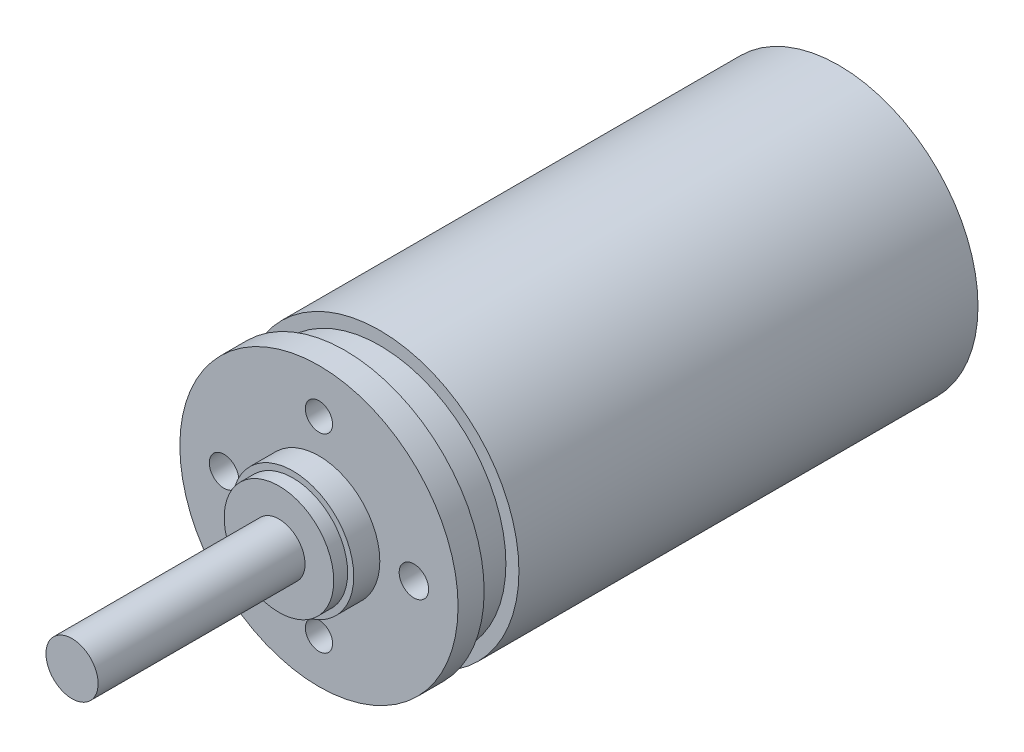
ISO-10303-21;
HEADER;
FILE_DESCRIPTION(('STEP AP214'),'2;1');
FILE_NAME('part.step','',(''),(''),'','','');
FILE_SCHEMA(('AUTOMOTIVE_DESIGN { 1 0 10303 214 1 1 1 1 }'));
ENDSEC;
DATA;
#1=APPLICATION_CONTEXT('core data for automotive mechanical design processes');
#2=APPLICATION_PROTOCOL_DEFINITION('international standard','automotive_design',2000,#1);
#3=PRODUCT_CONTEXT('',#1,'mechanical');
#4=PRODUCT('Part','Part','',(#3));
#5=PRODUCT_RELATED_PRODUCT_CATEGORY('part','',(#4));
#6=PRODUCT_DEFINITION_FORMATION('','',#4);
#7=PRODUCT_DEFINITION_CONTEXT('part definition',#1,'design');
#8=PRODUCT_DEFINITION('design','',#6,#7);
#9=PRODUCT_DEFINITION_SHAPE('','',#8);
#10=(LENGTH_UNIT() NAMED_UNIT(*) SI_UNIT(.MILLI.,.METRE.));
#11=(NAMED_UNIT(*) PLANE_ANGLE_UNIT() SI_UNIT($,.RADIAN.));
#12=(NAMED_UNIT(*) SI_UNIT($,.STERADIAN.) SOLID_ANGLE_UNIT());
#13=UNCERTAINTY_MEASURE_WITH_UNIT(LENGTH_MEASURE(1.E-05),#10,'distance_accuracy_value','');
#14=(GEOMETRIC_REPRESENTATION_CONTEXT(3) GLOBAL_UNCERTAINTY_ASSIGNED_CONTEXT((#13)) GLOBAL_UNIT_ASSIGNED_CONTEXT((#10,
#11,#12)) REPRESENTATION_CONTEXT('',''));
#15=CARTESIAN_POINT('',(0.,0.,0.));
#16=DIRECTION('',(0.,0.,1.));
#17=DIRECTION('',(1.,0.,0.));
#18=AXIS2_PLACEMENT_3D('',#15,#16,#17);
#19=CARTESIAN_POINT('',(0.,-0.750000000000002,14.2));
#20=DIRECTION('',(0.,0.,1.));
#21=DIRECTION('',(1.,0.,0.));
#22=AXIS2_PLACEMENT_3D('',#19,#20,#21);
#23=PLANE('',#22);
#24=CARTESIAN_POINT('',(0.,0.,14.2));
#25=DIRECTION('',(0.,0.,1.));
#26=DIRECTION('',(1.,0.,0.));
#27=AXIS2_PLACEMENT_3D('',#24,#25,#26);
#28=CIRCLE('',#27,1.5);
#29=CARTESIAN_POINT('',(1.5,0.,14.2));
#30=VERTEX_POINT('',#29);
#31=EDGE_CURVE('E19',#30,#30,#28,.F.);
#32=ORIENTED_EDGE('',*,*,#31,.F.);
#33=EDGE_LOOP('',(#32));
#34=FACE_BOUND('',#33,.T.);
#35=ADVANCED_FACE('F16',(#34),#23,.T.);
#36=CARTESIAN_POINT('',(0.,-1.5,9.9));
#37=DIRECTION('',(0.,0.,1.));
#38=DIRECTION('',(1.,0.,0.));
#39=AXIS2_PLACEMENT_3D('',#36,#37,#38);
#40=PLANE('',#39);
#41=DIRECTION('',(1.,0.,0.));
#42=VECTOR('',#41,1.);
#43=CARTESIAN_POINT('',(0.,-1.3,9.9));
#44=LINE('',#43,#42);
#45=CARTESIAN_POINT('',(-0.748331477354788,-1.3,9.9));
#46=VERTEX_POINT('',#45);
#47=CARTESIAN_POINT('',(0.748331477354788,-1.3,9.9));
#48=VERTEX_POINT('',#47);
#49=EDGE_CURVE('E40',#46,#48,#44,.T.);
#50=ORIENTED_EDGE('',*,*,#49,.T.);
#51=CARTESIAN_POINT('',(0.,0.,9.9));
#52=DIRECTION('',(0.,0.,1.));
#53=DIRECTION('',(1.,0.,0.));
#54=AXIS2_PLACEMENT_3D('',#51,#52,#53);
#55=CIRCLE('',#54,1.5);
#56=EDGE_CURVE('E50',#46,#48,#55,.T.);
#57=ORIENTED_EDGE('',*,*,#56,.F.);
#58=EDGE_LOOP('',(#50,#57));
#59=FACE_BOUND('',#58,.T.);
#60=ADVANCED_FACE('F51',(#59),#40,.F.);
#61=CARTESIAN_POINT('',(0.,-1.3,9.9));
#62=DIRECTION('',(0.,1.,0.));
#63=DIRECTION('',(0.,0.,1.));
#64=AXIS2_PLACEMENT_3D('',#61,#62,#63);
#65=PLANE('',#64);
#66=ORIENTED_EDGE('',*,*,#49,.F.);
#67=DIRECTION('',(0.,0.,1.));
#68=VECTOR('',#67,1.);
#69=CARTESIAN_POINT('',(-0.748331477354789,-1.3,8.25));
#70=LINE('',#69,#68);
#71=CARTESIAN_POINT('',(-0.748331477354788,-1.3,3.2));
#72=VERTEX_POINT('',#71);
#73=EDGE_CURVE('E44',#72,#46,#70,.T.);
#74=ORIENTED_EDGE('',*,*,#73,.F.);
#75=DIRECTION('',(-1.,0.,0.));
#76=VECTOR('',#75,1.);
#77=CARTESIAN_POINT('',(0.,-1.3,3.2));
#78=LINE('',#77,#76);
#79=CARTESIAN_POINT('',(0.748331477354788,-1.3,3.2));
#80=VERTEX_POINT('',#79);
#81=EDGE_CURVE('E33',#72,#80,#78,.F.);
#82=ORIENTED_EDGE('',*,*,#81,.T.);
#83=DIRECTION('',(0.,0.,1.));
#84=VECTOR('',#83,1.);
#85=CARTESIAN_POINT('',(0.748331477354788,-1.3,8.25));
#86=LINE('',#85,#84);
#87=EDGE_CURVE('E46',#48,#80,#86,.F.);
#88=ORIENTED_EDGE('',*,*,#87,.F.);
#89=EDGE_LOOP('',(#66,#74,#82,#88));
#90=FACE_BOUND('',#89,.T.);
#91=ADVANCED_FACE('F42',(#90),#65,.F.);
#92=CARTESIAN_POINT('',(0.,-1.3,3.2));
#93=DIRECTION('',(0.,0.,-1.));
#94=DIRECTION('',(-1.,0.,0.));
#95=AXIS2_PLACEMENT_3D('',#92,#93,#94);
#96=PLANE('',#95);
#97=ORIENTED_EDGE('',*,*,#81,.F.);
#98=CARTESIAN_POINT('',(0.,0.,3.2));
#99=DIRECTION('',(0.,0.,1.));
#100=DIRECTION('',(1.,0.,0.));
#101=AXIS2_PLACEMENT_3D('',#98,#99,#100);
#102=CIRCLE('',#101,1.5);
#103=EDGE_CURVE('E56',#80,#72,#102,.F.);
#104=ORIENTED_EDGE('',*,*,#103,.F.);
#105=EDGE_LOOP('',(#97,#104));
#106=FACE_BOUND('',#105,.T.);
#107=ADVANCED_FACE('F127',(#106),#96,.F.);
#108=CARTESIAN_POINT('',(0.,0.,8.25));
#109=DIRECTION('',(0.,0.,1.));
#110=DIRECTION('',(1.,0.,0.));
#111=AXIS2_PLACEMENT_3D('',#108,#109,#110);
#112=CYLINDRICAL_SURFACE('',#111,1.5);
#113=CARTESIAN_POINT('',(0.,0.,2.3));
#114=DIRECTION('',(0.,0.,1.));
#115=DIRECTION('',(1.,0.,0.));
#116=AXIS2_PLACEMENT_3D('',#113,#114,#115);
#117=CIRCLE('',#116,1.5);
#118=CARTESIAN_POINT('',(1.5,0.,2.3));
#119=VERTEX_POINT('',#118);
#120=EDGE_CURVE('E118',#119,#119,#117,.F.);
#121=ORIENTED_EDGE('',*,*,#120,.F.);
#122=EDGE_LOOP('',(#121));
#123=FACE_BOUND('',#122,.T.);
#124=ORIENTED_EDGE('',*,*,#87,.T.);
#125=ORIENTED_EDGE('',*,*,#103,.T.);
#126=ORIENTED_EDGE('',*,*,#73,.T.);
#127=ORIENTED_EDGE('',*,*,#56,.T.);
#128=EDGE_LOOP('',(#124,#125,#126,#127));
#129=FACE_BOUND('',#128,.T.);
#130=ORIENTED_EDGE('',*,*,#31,.T.);
#131=EDGE_LOOP('',(#130));
#132=FACE_BOUND('',#131,.T.);
#133=ADVANCED_FACE('F54',(#123,#129,#132),#112,.T.);
#134=CARTESIAN_POINT('',(0.,-2.325,2.3));
#135=DIRECTION('',(0.,0.,1.));
#136=DIRECTION('',(1.,0.,0.));
#137=AXIS2_PLACEMENT_3D('',#134,#135,#136);
#138=PLANE('',#137);
#139=ORIENTED_EDGE('',*,*,#120,.T.);
#140=EDGE_LOOP('',(#139));
#141=FACE_BOUND('',#140,.T.);
#142=CARTESIAN_POINT('',(0.,0.,2.3));
#143=DIRECTION('',(0.,0.,1.));
#144=DIRECTION('',(1.,0.,0.));
#145=AXIS2_PLACEMENT_3D('',#142,#143,#144);
#146=CIRCLE('',#145,3.15);
#147=CARTESIAN_POINT('',(3.15,0.,2.3));
#148=VERTEX_POINT('',#147);
#149=EDGE_CURVE('E115',#148,#148,#146,.F.);
#150=ORIENTED_EDGE('',*,*,#149,.F.);
#151=EDGE_LOOP('',(#150));
#152=FACE_BOUND('',#151,.T.);
#153=ADVANCED_FACE('F123',(#141,#152),#138,.T.);
#154=CARTESIAN_POINT('',(0.,0.,1.9));
#155=DIRECTION('',(0.,0.,1.));
#156=DIRECTION('',(1.,0.,0.));
#157=AXIS2_PLACEMENT_3D('',#154,#155,#156);
#158=CYLINDRICAL_SURFACE('',#157,3.15);
#159=CARTESIAN_POINT('',(0.,0.,1.5));
#160=DIRECTION('',(0.,0.,1.));
#161=DIRECTION('',(1.,0.,0.));
#162=AXIS2_PLACEMENT_3D('',#159,#160,#161);
#163=CIRCLE('',#162,3.15);
#164=CARTESIAN_POINT('',(3.15,0.,1.5));
#165=VERTEX_POINT('',#164);
#166=EDGE_CURVE('E112',#165,#165,#163,.F.);
#167=ORIENTED_EDGE('',*,*,#166,.F.);
#168=EDGE_LOOP('',(#167));
#169=FACE_BOUND('',#168,.T.);
#170=ORIENTED_EDGE('',*,*,#149,.T.);
#171=EDGE_LOOP('',(#170));
#172=FACE_BOUND('',#171,.T.);
#173=ADVANCED_FACE('F134',(#169,#172),#158,.T.);
#174=CARTESIAN_POINT('',(0.,5.46,-3.));
#175=DIRECTION('',(0.,0.,-1.));
#176=DIRECTION('',(-1.,0.,0.));
#177=AXIS2_PLACEMENT_3D('',#174,#175,#176);
#178=PLANE('',#177);
#179=CARTESIAN_POINT('',(0.,5.46,-3.));
#180=DIRECTION('',(0.,0.,-1.));
#181=DIRECTION('',(-1.,0.,0.));
#182=AXIS2_PLACEMENT_3D('',#179,#180,#181);
#183=CIRCLE('',#182,0.7835);
#184=CARTESIAN_POINT('',(-0.7835,5.46,-3.));
#185=VERTEX_POINT('',#184);
#186=EDGE_CURVE('E109',#185,#185,#183,.F.);
#187=ORIENTED_EDGE('',*,*,#186,.T.);
#188=EDGE_LOOP('',(#187));
#189=FACE_BOUND('',#188,.T.);
#190=ADVANCED_FACE('F213',(#189),#178,.F.);
#191=CARTESIAN_POINT('',(0.,-5.46,-3.));
#192=DIRECTION('',(0.,0.,1.));
#193=DIRECTION('',(1.,0.,0.));
#194=AXIS2_PLACEMENT_3D('',#191,#192,#193);
#195=PLANE('',#194);
#196=CARTESIAN_POINT('',(0.,-5.46,-3.));
#197=DIRECTION('',(0.,0.,1.));
#198=DIRECTION('',(1.,0.,0.));
#199=AXIS2_PLACEMENT_3D('',#196,#197,#198);
#200=CIRCLE('',#199,0.7835);
#201=CARTESIAN_POINT('',(0.7835,-5.46,-3.));
#202=VERTEX_POINT('',#201);
#203=EDGE_CURVE('E106',#202,#202,#200,.T.);
#204=ORIENTED_EDGE('',*,*,#203,.T.);
#205=EDGE_LOOP('',(#204));
#206=FACE_BOUND('',#205,.T.);
#207=ADVANCED_FACE('F209',(#206),#195,.T.);
#208=CARTESIAN_POINT('',(5.46,0.,-3.));
#209=DIRECTION('',(0.,0.,-1.));
#210=DIRECTION('',(-1.,0.,0.));
#211=AXIS2_PLACEMENT_3D('',#208,#209,#210);
#212=PLANE('',#211);
#213=CARTESIAN_POINT('',(5.46,0.,-3.));
#214=DIRECTION('',(0.,0.,-1.));
#215=DIRECTION('',(-1.,0.,0.));
#216=AXIS2_PLACEMENT_3D('',#213,#214,#215);
#217=CIRCLE('',#216,0.847);
#218=CARTESIAN_POINT('',(4.613,0.,-3.));
#219=VERTEX_POINT('',#218);
#220=EDGE_CURVE('E103',#219,#219,#217,.F.);
#221=ORIENTED_EDGE('',*,*,#220,.T.);
#222=EDGE_LOOP('',(#221));
#223=FACE_BOUND('',#222,.T.);
#224=ADVANCED_FACE('F205',(#223),#212,.F.);
#225=CARTESIAN_POINT('',(-5.46,0.,-3.));
#226=DIRECTION('',(0.,0.,1.));
#227=DIRECTION('',(1.,0.,0.));
#228=AXIS2_PLACEMENT_3D('',#225,#226,#227);
#229=PLANE('',#228);
#230=CARTESIAN_POINT('',(-5.46,0.,-3.));
#231=DIRECTION('',(0.,0.,1.));
#232=DIRECTION('',(1.,0.,0.));
#233=AXIS2_PLACEMENT_3D('',#230,#231,#232);
#234=CIRCLE('',#233,0.847);
#235=CARTESIAN_POINT('',(-4.613,0.,-3.));
#236=VERTEX_POINT('',#235);
#237=EDGE_CURVE('E100',#236,#236,#234,.T.);
#238=ORIENTED_EDGE('',*,*,#237,.T.);
#239=EDGE_LOOP('',(#238));
#240=FACE_BOUND('',#239,.T.);
#241=ADVANCED_FACE('F201',(#240),#229,.T.);
#242=CARTESIAN_POINT('',(0.,-3.325,1.5));
#243=DIRECTION('',(0.,0.,1.));
#244=DIRECTION('',(1.,0.,0.));
#245=AXIS2_PLACEMENT_3D('',#242,#243,#244);
#246=PLANE('',#245);
#247=ORIENTED_EDGE('',*,*,#166,.T.);
#248=EDGE_LOOP('',(#247));
#249=FACE_BOUND('',#248,.T.);
#250=CARTESIAN_POINT('',(0.,0.,1.5));
#251=DIRECTION('',(0.,0.,1.));
#252=DIRECTION('',(1.,0.,0.));
#253=AXIS2_PLACEMENT_3D('',#250,#251,#252);
#254=CIRCLE('',#253,3.5);
#255=CARTESIAN_POINT('',(3.5,0.,1.5));
#256=VERTEX_POINT('',#255);
#257=EDGE_CURVE('E97',#256,#256,#254,.F.);
#258=ORIENTED_EDGE('',*,*,#257,.F.);
#259=EDGE_LOOP('',(#258));
#260=FACE_BOUND('',#259,.T.);
#261=ADVANCED_FACE('F197',(#249,#260),#246,.T.);
#262=CARTESIAN_POINT('',(0.,5.46,-1.5));
#263=DIRECTION('',(0.,0.,-1.));
#264=DIRECTION('',(-1.,0.,0.));
#265=AXIS2_PLACEMENT_3D('',#262,#263,#264);
#266=CYLINDRICAL_SURFACE('',#265,0.7835);
#267=ORIENTED_EDGE('',*,*,#186,.F.);
#268=EDGE_LOOP('',(#267));
#269=FACE_BOUND('',#268,.T.);
#270=CARTESIAN_POINT('',(0.,5.46,0.));
#271=DIRECTION('',(0.,0.,-1.));
#272=DIRECTION('',(-1.,0.,0.));
#273=AXIS2_PLACEMENT_3D('',#270,#271,#272);
#274=CIRCLE('',#273,0.7835);
#275=CARTESIAN_POINT('',(-0.7835,5.46,0.));
#276=VERTEX_POINT('',#275);
#277=EDGE_CURVE('E94',#276,#276,#274,.T.);
#278=ORIENTED_EDGE('',*,*,#277,.F.);
#279=EDGE_LOOP('',(#278));
#280=FACE_BOUND('',#279,.T.);
#281=ADVANCED_FACE('F193',(#269,#280),#266,.F.);
#282=CARTESIAN_POINT('',(0.,-5.46,-1.5));
#283=DIRECTION('',(0.,0.,1.));
#284=DIRECTION('',(1.,0.,0.));
#285=AXIS2_PLACEMENT_3D('',#282,#283,#284);
#286=CYLINDRICAL_SURFACE('',#285,0.7835);
#287=ORIENTED_EDGE('',*,*,#203,.F.);
#288=EDGE_LOOP('',(#287));
#289=FACE_BOUND('',#288,.T.);
#290=CARTESIAN_POINT('',(0.,-5.46,0.));
#291=DIRECTION('',(0.,0.,1.));
#292=DIRECTION('',(1.,0.,0.));
#293=AXIS2_PLACEMENT_3D('',#290,#291,#292);
#294=CIRCLE('',#293,0.7835);
#295=CARTESIAN_POINT('',(0.7835,-5.46,0.));
#296=VERTEX_POINT('',#295);
#297=EDGE_CURVE('E91',#296,#296,#294,.F.);
#298=ORIENTED_EDGE('',*,*,#297,.F.);
#299=EDGE_LOOP('',(#298));
#300=FACE_BOUND('',#299,.T.);
#301=ADVANCED_FACE('F189',(#289,#300),#286,.F.);
#302=CARTESIAN_POINT('',(5.46,0.,-1.5));
#303=DIRECTION('',(0.,0.,-1.));
#304=DIRECTION('',(-1.,0.,0.));
#305=AXIS2_PLACEMENT_3D('',#302,#303,#304);
#306=CYLINDRICAL_SURFACE('',#305,0.847);
#307=ORIENTED_EDGE('',*,*,#220,.F.);
#308=EDGE_LOOP('',(#307));
#309=FACE_BOUND('',#308,.T.);
#310=CARTESIAN_POINT('',(5.46,0.,0.));
#311=DIRECTION('',(0.,0.,-1.));
#312=DIRECTION('',(-1.,0.,0.));
#313=AXIS2_PLACEMENT_3D('',#310,#311,#312);
#314=CIRCLE('',#313,0.847);
#315=CARTESIAN_POINT('',(4.613,0.,0.));
#316=VERTEX_POINT('',#315);
#317=EDGE_CURVE('E88',#316,#316,#314,.T.);
#318=ORIENTED_EDGE('',*,*,#317,.F.);
#319=EDGE_LOOP('',(#318));
#320=FACE_BOUND('',#319,.T.);
#321=ADVANCED_FACE('F185',(#309,#320),#306,.F.);
#322=CARTESIAN_POINT('',(-5.46,0.,-1.5));
#323=DIRECTION('',(0.,0.,1.));
#324=DIRECTION('',(1.,0.,0.));
#325=AXIS2_PLACEMENT_3D('',#322,#323,#324);
#326=CYLINDRICAL_SURFACE('',#325,0.847);
#327=ORIENTED_EDGE('',*,*,#237,.F.);
#328=EDGE_LOOP('',(#327));
#329=FACE_BOUND('',#328,.T.);
#330=CARTESIAN_POINT('',(-5.46,0.,0.));
#331=DIRECTION('',(0.,0.,1.));
#332=DIRECTION('',(1.,0.,0.));
#333=AXIS2_PLACEMENT_3D('',#330,#331,#332);
#334=CIRCLE('',#333,0.847);
#335=CARTESIAN_POINT('',(-4.613,0.,0.));
#336=VERTEX_POINT('',#335);
#337=EDGE_CURVE('E85',#336,#336,#334,.F.);
#338=ORIENTED_EDGE('',*,*,#337,.F.);
#339=EDGE_LOOP('',(#338));
#340=FACE_BOUND('',#339,.T.);
#341=ADVANCED_FACE('F181',(#329,#340),#326,.F.);
#342=CARTESIAN_POINT('',(0.,0.,0.75));
#343=DIRECTION('',(0.,0.,1.));
#344=DIRECTION('',(1.,0.,0.));
#345=AXIS2_PLACEMENT_3D('',#342,#343,#344);
#346=CYLINDRICAL_SURFACE('',#345,3.5);
#347=CARTESIAN_POINT('',(0.,0.,0.));
#348=DIRECTION('',(0.,0.,1.));
#349=DIRECTION('',(1.,0.,0.));
#350=AXIS2_PLACEMENT_3D('',#347,#348,#349);
#351=CIRCLE('',#350,3.5);
#352=CARTESIAN_POINT('',(3.5,0.,0.));
#353=VERTEX_POINT('',#352);
#354=EDGE_CURVE('E82',#353,#353,#351,.F.);
#355=ORIENTED_EDGE('',*,*,#354,.F.);
#356=EDGE_LOOP('',(#355));
#357=FACE_BOUND('',#356,.T.);
#358=ORIENTED_EDGE('',*,*,#257,.T.);
#359=EDGE_LOOP('',(#358));
#360=FACE_BOUND('',#359,.T.);
#361=ADVANCED_FACE('F177',(#357,#360),#346,.T.);
#362=CARTESIAN_POINT('',(0.,-5.75,0.));
#363=DIRECTION('',(0.,0.,1.));
#364=DIRECTION('',(1.,0.,0.));
#365=AXIS2_PLACEMENT_3D('',#362,#363,#364);
#366=PLANE('',#365);
#367=ORIENTED_EDGE('',*,*,#354,.T.);
#368=EDGE_LOOP('',(#367));
#369=FACE_BOUND('',#368,.T.);
#370=ORIENTED_EDGE('',*,*,#337,.T.);
#371=EDGE_LOOP('',(#370));
#372=FACE_BOUND('',#371,.T.);
#373=ORIENTED_EDGE('',*,*,#317,.T.);
#374=EDGE_LOOP('',(#373));
#375=FACE_BOUND('',#374,.T.);
#376=ORIENTED_EDGE('',*,*,#297,.T.);
#377=EDGE_LOOP('',(#376));
#378=FACE_BOUND('',#377,.T.);
#379=ORIENTED_EDGE('',*,*,#277,.T.);
#380=EDGE_LOOP('',(#379));
#381=FACE_BOUND('',#380,.T.);
#382=CARTESIAN_POINT('',(0.,0.,0.));
#383=DIRECTION('',(0.,0.,1.));
#384=DIRECTION('',(1.,0.,0.));
#385=AXIS2_PLACEMENT_3D('',#382,#383,#384);
#386=CIRCLE('',#385,8.);
#387=CARTESIAN_POINT('',(8.,0.,0.));
#388=VERTEX_POINT('',#387);
#389=EDGE_CURVE('E79',#388,#388,#386,.F.);
#390=ORIENTED_EDGE('',*,*,#389,.F.);
#391=EDGE_LOOP('',(#390));
#392=FACE_BOUND('',#391,.T.);
#393=ADVANCED_FACE('F173',(#369,#372,#375,#378,#381,#392),#366,.T.);
#394=CARTESIAN_POINT('',(0.,0.,-0.750000000000002));
#395=DIRECTION('',(0.,0.,1.));
#396=DIRECTION('',(1.,0.,0.));
#397=AXIS2_PLACEMENT_3D('',#394,#395,#396);
#398=CYLINDRICAL_SURFACE('',#397,8.);
#399=CARTESIAN_POINT('',(0.,0.,-1.5));
#400=DIRECTION('',(0.,0.,1.));
#401=DIRECTION('',(1.,0.,0.));
#402=AXIS2_PLACEMENT_3D('',#399,#400,#401);
#403=CIRCLE('',#402,8.);
#404=CARTESIAN_POINT('',(8.,0.,-1.5));
#405=VERTEX_POINT('',#404);
#406=EDGE_CURVE('E76',#405,#405,#403,.F.);
#407=ORIENTED_EDGE('',*,*,#406,.F.);
#408=EDGE_LOOP('',(#407));
#409=FACE_BOUND('',#408,.T.);
#410=ORIENTED_EDGE('',*,*,#389,.T.);
#411=EDGE_LOOP('',(#410));
#412=FACE_BOUND('',#411,.T.);
#413=ADVANCED_FACE('F169',(#409,#412),#398,.T.);
#414=CARTESIAN_POINT('',(0.,-7.625,-1.5));
#415=DIRECTION('',(0.,0.,-1.));
#416=DIRECTION('',(-1.,0.,0.));
#417=AXIS2_PLACEMENT_3D('',#414,#415,#416);
#418=PLANE('',#417);
#419=CARTESIAN_POINT('',(0.,0.,-1.5));
#420=DIRECTION('',(0.,0.,1.));
#421=DIRECTION('',(1.,0.,0.));
#422=AXIS2_PLACEMENT_3D('',#419,#420,#421);
#423=CIRCLE('',#422,7.25);
#424=CARTESIAN_POINT('',(7.25,0.,-1.5));
#425=VERTEX_POINT('',#424);
#426=EDGE_CURVE('E73',#425,#425,#423,.F.);
#427=ORIENTED_EDGE('',*,*,#426,.F.);
#428=EDGE_LOOP('',(#427));
#429=FACE_BOUND('',#428,.T.);
#430=ORIENTED_EDGE('',*,*,#406,.T.);
#431=EDGE_LOOP('',(#430));
#432=FACE_BOUND('',#431,.T.);
#433=ADVANCED_FACE('F165',(#429,#432),#418,.T.);
#434=CARTESIAN_POINT('',(0.,0.,-17.));
#435=DIRECTION('',(0.,0.,1.));
#436=DIRECTION('',(1.,0.,0.));
#437=AXIS2_PLACEMENT_3D('',#434,#435,#436);
#438=PLANE('',#437);
#439=CARTESIAN_POINT('',(0.,0.,-17.));
#440=DIRECTION('',(0.,0.,1.));
#441=DIRECTION('',(1.,0.,0.));
#442=AXIS2_PLACEMENT_3D('',#439,#440,#441);
#443=CIRCLE('',#442,7.5);
#444=CARTESIAN_POINT('',(7.5,0.,-17.));
#445=VERTEX_POINT('',#444);
#446=EDGE_CURVE('E70',#445,#445,#443,.F.);
#447=ORIENTED_EDGE('',*,*,#446,.T.);
#448=EDGE_LOOP('',(#447));
#449=FACE_BOUND('',#448,.T.);
#450=ADVANCED_FACE('F161',(#449),#438,.F.);
#451=CARTESIAN_POINT('',(0.,0.,-2.5));
#452=DIRECTION('',(0.,0.,1.));
#453=DIRECTION('',(1.,0.,0.));
#454=AXIS2_PLACEMENT_3D('',#451,#452,#453);
#455=CYLINDRICAL_SURFACE('',#454,7.25);
#456=CARTESIAN_POINT('',(0.,0.,-3.5));
#457=DIRECTION('',(0.,0.,1.));
#458=DIRECTION('',(1.,0.,0.));
#459=AXIS2_PLACEMENT_3D('',#456,#457,#458);
#460=CIRCLE('',#459,7.25);
#461=CARTESIAN_POINT('',(7.25,0.,-3.5));
#462=VERTEX_POINT('',#461);
#463=EDGE_CURVE('E67',#462,#462,#460,.F.);
#464=ORIENTED_EDGE('',*,*,#463,.F.);
#465=EDGE_LOOP('',(#464));
#466=FACE_BOUND('',#465,.T.);
#467=ORIENTED_EDGE('',*,*,#426,.T.);
#468=EDGE_LOOP('',(#467));
#469=FACE_BOUND('',#468,.T.);
#470=ADVANCED_FACE('F157',(#466,#469),#455,.T.);
#471=CARTESIAN_POINT('',(0.,0.,-29.9));
#472=DIRECTION('',(0.,0.,1.));
#473=DIRECTION('',(1.,0.,0.));
#474=AXIS2_PLACEMENT_3D('',#471,#472,#473);
#475=CYLINDRICAL_SURFACE('',#474,7.5);
#476=CARTESIAN_POINT('',(0.,0.,-29.9));
#477=DIRECTION('',(0.,0.,1.));
#478=DIRECTION('',(1.,0.,0.));
#479=AXIS2_PLACEMENT_3D('',#476,#477,#478);
#480=CIRCLE('',#479,7.5);
#481=CARTESIAN_POINT('',(7.5,0.,-29.9));
#482=VERTEX_POINT('',#481);
#483=EDGE_CURVE('E64',#482,#482,#480,.T.);
#484=ORIENTED_EDGE('',*,*,#483,.F.);
#485=EDGE_LOOP('',(#484));
#486=FACE_BOUND('',#485,.T.);
#487=ORIENTED_EDGE('',*,*,#446,.F.);
#488=EDGE_LOOP('',(#487));
#489=FACE_BOUND('',#488,.T.);
#490=ADVANCED_FACE('F153',(#486,#489),#475,.F.);
#491=CARTESIAN_POINT('',(0.,-7.625,-3.5));
#492=DIRECTION('',(0.,0.,1.));
#493=DIRECTION('',(1.,0.,0.));
#494=AXIS2_PLACEMENT_3D('',#491,#492,#493);
#495=PLANE('',#494);
#496=ORIENTED_EDGE('',*,*,#463,.T.);
#497=EDGE_LOOP('',(#496));
#498=FACE_BOUND('',#497,.T.);
#499=CARTESIAN_POINT('',(0.,0.,-3.5));
#500=DIRECTION('',(0.,0.,1.));
#501=DIRECTION('',(1.,0.,0.));
#502=AXIS2_PLACEMENT_3D('',#499,#500,#501);
#503=CIRCLE('',#502,8.);
#504=CARTESIAN_POINT('',(8.,0.,-3.5));
#505=VERTEX_POINT('',#504);
#506=EDGE_CURVE('E25',#505,#505,#503,.F.);
#507=ORIENTED_EDGE('',*,*,#506,.F.);
#508=EDGE_LOOP('',(#507));
#509=FACE_BOUND('',#508,.T.);
#510=ADVANCED_FACE('F146',(#498,#509),#495,.T.);
#511=CARTESIAN_POINT('',(0.,-4.,-29.9));
#512=DIRECTION('',(0.,0.,-1.));
#513=DIRECTION('',(-1.,0.,0.));
#514=AXIS2_PLACEMENT_3D('',#511,#512,#513);
#515=PLANE('',#514);
#516=ORIENTED_EDGE('',*,*,#483,.T.);
#517=EDGE_LOOP('',(#516));
#518=FACE_BOUND('',#517,.T.);
#519=CARTESIAN_POINT('',(0.,0.,-29.9));
#520=DIRECTION('',(0.,0.,1.));
#521=DIRECTION('',(1.,0.,0.));
#522=AXIS2_PLACEMENT_3D('',#519,#520,#521);
#523=CIRCLE('',#522,8.);
#524=CARTESIAN_POINT('',(8.,0.,-29.9));
#525=VERTEX_POINT('',#524);
#526=EDGE_CURVE('E10',#525,#525,#523,.T.);
#527=ORIENTED_EDGE('',*,*,#526,.F.);
#528=EDGE_LOOP('',(#527));
#529=FACE_BOUND('',#528,.T.);
#530=ADVANCED_FACE('F140',(#518,#529),#515,.T.);
#531=CARTESIAN_POINT('',(0.,0.,-16.7));
#532=DIRECTION('',(0.,0.,1.));
#533=DIRECTION('',(1.,0.,0.));
#534=AXIS2_PLACEMENT_3D('',#531,#532,#533);
#535=CYLINDRICAL_SURFACE('',#534,8.);
#536=ORIENTED_EDGE('',*,*,#526,.T.);
#537=EDGE_LOOP('',(#536));
#538=FACE_BOUND('',#537,.T.);
#539=ORIENTED_EDGE('',*,*,#506,.T.);
#540=EDGE_LOOP('',(#539));
#541=FACE_BOUND('',#540,.T.);
#542=ADVANCED_FACE('F138',(#538,#541),#535,.T.);
#543=CLOSED_SHELL('',(#35,#60,#91,#107,#133,#153,#173,#190,#207,#224,#241,#261,#281,#301,#321,
#341,#361,#393,#413,#433,#450,#470,#490,#510,#530,#542));
#544=MANIFOLD_SOLID_BREP('B1',#543);
#545=ADVANCED_BREP_SHAPE_REPRESENTATION('',(#18,#544),#14);
#546=SHAPE_DEFINITION_REPRESENTATION(#9,#545);
ENDSEC;
END-ISO-10303-21;
